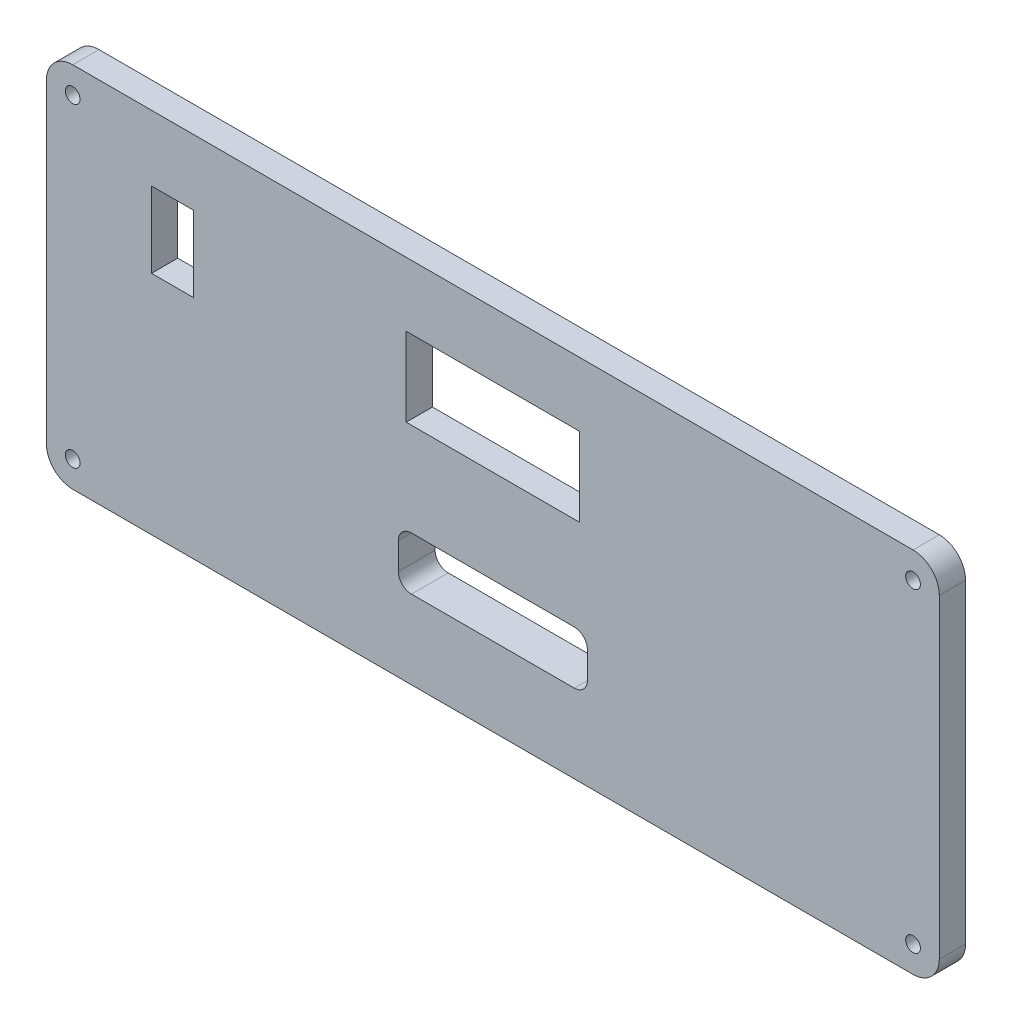
ISO-10303-21;
HEADER;
FILE_DESCRIPTION(('STEP AP214'),'2;1');
FILE_NAME('part.step','',(''),(''),'','','');
FILE_SCHEMA(('AUTOMOTIVE_DESIGN { 1 0 10303 214 1 1 1 1 }'));
ENDSEC;
DATA;
#1=APPLICATION_CONTEXT('core data for automotive mechanical design processes');
#2=APPLICATION_PROTOCOL_DEFINITION('international standard','automotive_design',2000,#1);
#3=PRODUCT_CONTEXT('',#1,'mechanical');
#4=PRODUCT('Part','Part','',(#3));
#5=PRODUCT_RELATED_PRODUCT_CATEGORY('part','',(#4));
#6=PRODUCT_DEFINITION_FORMATION('','',#4);
#7=PRODUCT_DEFINITION_CONTEXT('part definition',#1,'design');
#8=PRODUCT_DEFINITION('design','',#6,#7);
#9=PRODUCT_DEFINITION_SHAPE('','',#8);
#10=(LENGTH_UNIT() NAMED_UNIT(*) SI_UNIT(.MILLI.,.METRE.));
#11=(NAMED_UNIT(*) PLANE_ANGLE_UNIT() SI_UNIT($,.RADIAN.));
#12=(NAMED_UNIT(*) SI_UNIT($,.STERADIAN.) SOLID_ANGLE_UNIT());
#13=UNCERTAINTY_MEASURE_WITH_UNIT(LENGTH_MEASURE(1.E-05),#10,'distance_accuracy_value','');
#14=(GEOMETRIC_REPRESENTATION_CONTEXT(3) GLOBAL_UNCERTAINTY_ASSIGNED_CONTEXT((#13)) GLOBAL_UNIT_ASSIGNED_CONTEXT((#10,
#11,#12)) REPRESENTATION_CONTEXT('',''));
#15=CARTESIAN_POINT('',(0.,0.,0.));
#16=DIRECTION('',(0.,0.,1.));
#17=DIRECTION('',(1.,0.,0.));
#18=AXIS2_PLACEMENT_3D('',#15,#16,#17);
#19=CARTESIAN_POINT('',(0.,0.,5.));
#20=DIRECTION('',(0.,0.,1.));
#21=DIRECTION('',(1.,0.,0.));
#22=AXIS2_PLACEMENT_3D('',#19,#20,#21);
#23=PLANE('',#22);
#24=DIRECTION('',(0.,1.,0.));
#25=VECTOR('',#24,1.);
#26=CARTESIAN_POINT('',(-18.,-20.04,5.));
#27=LINE('',#26,#25);
#28=CARTESIAN_POINT('',(-18.,-17.54,5.));
#29=VERTEX_POINT('',#28);
#30=CARTESIAN_POINT('',(-18.,-12.46,5.));
#31=VERTEX_POINT('',#30);
#32=EDGE_CURVE('E252',#29,#31,#27,.T.);
#33=ORIENTED_EDGE('',*,*,#32,.T.);
#34=CARTESIAN_POINT('',(-15.5,-12.46,5.));
#35=DIRECTION('',(0.,0.,1.));
#36=DIRECTION('',(1.,0.,0.));
#37=AXIS2_PLACEMENT_3D('',#34,#35,#36);
#38=CIRCLE('',#37,2.5);
#39=CARTESIAN_POINT('',(-15.5,-9.96000000000001,5.));
#40=VERTEX_POINT('',#39);
#41=EDGE_CURVE('E441',#31,#40,#38,.F.);
#42=ORIENTED_EDGE('',*,*,#41,.T.);
#43=DIRECTION('',(1.,0.,0.));
#44=VECTOR('',#43,1.);
#45=CARTESIAN_POINT('',(-18.,-9.96000000000001,5.));
#46=LINE('',#45,#44);
#47=CARTESIAN_POINT('',(15.5,-9.96000000000002,5.));
#48=VERTEX_POINT('',#47);
#49=EDGE_CURVE('E247',#40,#48,#46,.T.);
#50=ORIENTED_EDGE('',*,*,#49,.T.);
#51=CARTESIAN_POINT('',(15.5,-12.46,5.));
#52=DIRECTION('',(0.,0.,1.));
#53=DIRECTION('',(1.,0.,0.));
#54=AXIS2_PLACEMENT_3D('',#51,#52,#53);
#55=CIRCLE('',#54,2.5);
#56=CARTESIAN_POINT('',(18.,-12.46,5.));
#57=VERTEX_POINT('',#56);
#58=EDGE_CURVE('E437',#48,#57,#55,.F.);
#59=ORIENTED_EDGE('',*,*,#58,.T.);
#60=DIRECTION('',(0.,-1.,0.));
#61=VECTOR('',#60,1.);
#62=CARTESIAN_POINT('',(18.,-9.96000000000002,5.));
#63=LINE('',#62,#61);
#64=CARTESIAN_POINT('',(18.,-17.54,5.));
#65=VERTEX_POINT('',#64);
#66=EDGE_CURVE('E459',#57,#65,#63,.T.);
#67=ORIENTED_EDGE('',*,*,#66,.T.);
#68=CARTESIAN_POINT('',(15.5,-17.54,5.));
#69=DIRECTION('',(0.,0.,1.));
#70=DIRECTION('',(1.,0.,0.));
#71=AXIS2_PLACEMENT_3D('',#68,#69,#70);
#72=CIRCLE('',#71,2.5);
#73=CARTESIAN_POINT('',(15.5,-20.04,5.));
#74=VERTEX_POINT('',#73);
#75=EDGE_CURVE('E433',#65,#74,#72,.F.);
#76=ORIENTED_EDGE('',*,*,#75,.T.);
#77=DIRECTION('',(-1.,0.,0.));
#78=VECTOR('',#77,1.);
#79=CARTESIAN_POINT('',(-18.,-20.04,5.));
#80=LINE('',#79,#78);
#81=CARTESIAN_POINT('',(-15.5,-20.04,5.));
#82=VERTEX_POINT('',#81);
#83=EDGE_CURVE('E457',#74,#82,#80,.T.);
#84=ORIENTED_EDGE('',*,*,#83,.T.);
#85=CARTESIAN_POINT('',(-15.5,-17.54,5.));
#86=DIRECTION('',(0.,0.,1.));
#87=DIRECTION('',(1.,0.,0.));
#88=AXIS2_PLACEMENT_3D('',#85,#86,#87);
#89=CIRCLE('',#88,2.5);
#90=EDGE_CURVE('E11',#82,#29,#89,.F.);
#91=ORIENTED_EDGE('',*,*,#90,.T.);
#92=EDGE_LOOP('',(#33,#42,#50,#59,#67,#76,#84,#91));
#93=FACE_BOUND('',#92,.T.);
#94=CARTESIAN_POINT('',(-80.,-30.,5.));
#95=DIRECTION('',(0.,0.,1.));
#96=DIRECTION('',(1.,0.,0.));
#97=AXIS2_PLACEMENT_3D('',#94,#95,#96);
#98=CIRCLE('',#97,1.4);
#99=CARTESIAN_POINT('',(-78.6,-30.,5.));
#100=VERTEX_POINT('',#99);
#101=EDGE_CURVE('E321',#100,#100,#98,.T.);
#102=ORIENTED_EDGE('',*,*,#101,.F.);
#103=EDGE_LOOP('',(#102));
#104=FACE_BOUND('',#103,.T.);
#105=CARTESIAN_POINT('',(80.,30.,5.));
#106=DIRECTION('',(0.,0.,1.));
#107=DIRECTION('',(1.,0.,0.));
#108=AXIS2_PLACEMENT_3D('',#105,#106,#107);
#109=CIRCLE('',#108,1.4);
#110=CARTESIAN_POINT('',(81.4,30.,5.));
#111=VERTEX_POINT('',#110);
#112=EDGE_CURVE('E324',#111,#111,#109,.T.);
#113=ORIENTED_EDGE('',*,*,#112,.F.);
#114=EDGE_LOOP('',(#113));
#115=FACE_BOUND('',#114,.T.);
#116=CARTESIAN_POINT('',(80.,-30.,5.));
#117=DIRECTION('',(0.,0.,1.));
#118=DIRECTION('',(1.,0.,0.));
#119=AXIS2_PLACEMENT_3D('',#116,#117,#118);
#120=CIRCLE('',#119,1.4);
#121=CARTESIAN_POINT('',(81.4,-30.,5.));
#122=VERTEX_POINT('',#121);
#123=EDGE_CURVE('E330',#122,#122,#120,.T.);
#124=ORIENTED_EDGE('',*,*,#123,.F.);
#125=EDGE_LOOP('',(#124));
#126=FACE_BOUND('',#125,.T.);
#127=CARTESIAN_POINT('',(-80.,30.,5.));
#128=DIRECTION('',(0.,0.,1.));
#129=DIRECTION('',(1.,0.,0.));
#130=AXIS2_PLACEMENT_3D('',#127,#128,#129);
#131=CIRCLE('',#130,1.4);
#132=CARTESIAN_POINT('',(-78.6,30.,5.));
#133=VERTEX_POINT('',#132);
#134=EDGE_CURVE('E335',#133,#133,#131,.T.);
#135=ORIENTED_EDGE('',*,*,#134,.F.);
#136=EDGE_LOOP('',(#135));
#137=FACE_BOUND('',#136,.T.);
#138=DIRECTION('',(-1.,0.,0.));
#139=VECTOR('',#138,1.);
#140=CARTESIAN_POINT('',(-85.,35.,5.));
#141=LINE('',#140,#139);
#142=CARTESIAN_POINT('',(80.,35.,5.));
#143=VERTEX_POINT('',#142);
#144=CARTESIAN_POINT('',(-80.,35.,5.));
#145=VERTEX_POINT('',#144);
#146=EDGE_CURVE('E344',#143,#145,#141,.T.);
#147=ORIENTED_EDGE('',*,*,#146,.T.);
#148=CARTESIAN_POINT('',(-80.,30.,5.));
#149=DIRECTION('',(0.,0.,1.));
#150=DIRECTION('',(1.,0.,0.));
#151=AXIS2_PLACEMENT_3D('',#148,#149,#150);
#152=CIRCLE('',#151,5.);
#153=CARTESIAN_POINT('',(-85.,30.,5.));
#154=VERTEX_POINT('',#153);
#155=EDGE_CURVE('E388',#145,#154,#152,.T.);
#156=ORIENTED_EDGE('',*,*,#155,.T.);
#157=DIRECTION('',(0.,-1.,0.));
#158=VECTOR('',#157,1.);
#159=CARTESIAN_POINT('',(-85.,35.,5.));
#160=LINE('',#159,#158);
#161=CARTESIAN_POINT('',(-85.,-30.,5.));
#162=VERTEX_POINT('',#161);
#163=EDGE_CURVE('E348',#154,#162,#160,.T.);
#164=ORIENTED_EDGE('',*,*,#163,.T.);
#165=CARTESIAN_POINT('',(-80.,-30.,5.));
#166=DIRECTION('',(0.,0.,1.));
#167=DIRECTION('',(1.,0.,0.));
#168=AXIS2_PLACEMENT_3D('',#165,#166,#167);
#169=CIRCLE('',#168,5.);
#170=CARTESIAN_POINT('',(-80.,-35.,5.));
#171=VERTEX_POINT('',#170);
#172=EDGE_CURVE('E386',#162,#171,#169,.T.);
#173=ORIENTED_EDGE('',*,*,#172,.T.);
#174=DIRECTION('',(1.,0.,0.));
#175=VECTOR('',#174,1.);
#176=CARTESIAN_POINT('',(-85.,-35.,5.));
#177=LINE('',#176,#175);
#178=CARTESIAN_POINT('',(80.,-35.,5.));
#179=VERTEX_POINT('',#178);
#180=EDGE_CURVE('E351',#171,#179,#177,.T.);
#181=ORIENTED_EDGE('',*,*,#180,.T.);
#182=CARTESIAN_POINT('',(80.,-30.,5.));
#183=DIRECTION('',(0.,0.,1.));
#184=DIRECTION('',(1.,0.,0.));
#185=AXIS2_PLACEMENT_3D('',#182,#183,#184);
#186=CIRCLE('',#185,5.);
#187=CARTESIAN_POINT('',(85.,-30.,5.));
#188=VERTEX_POINT('',#187);
#189=EDGE_CURVE('E384',#179,#188,#186,.T.);
#190=ORIENTED_EDGE('',*,*,#189,.T.);
#191=DIRECTION('',(0.,1.,0.));
#192=VECTOR('',#191,1.);
#193=CARTESIAN_POINT('',(85.,35.,5.));
#194=LINE('',#193,#192);
#195=CARTESIAN_POINT('',(85.,30.,5.));
#196=VERTEX_POINT('',#195);
#197=EDGE_CURVE('E341',#188,#196,#194,.T.);
#198=ORIENTED_EDGE('',*,*,#197,.T.);
#199=CARTESIAN_POINT('',(80.,30.,5.));
#200=DIRECTION('',(0.,0.,1.));
#201=DIRECTION('',(1.,0.,0.));
#202=AXIS2_PLACEMENT_3D('',#199,#200,#201);
#203=CIRCLE('',#202,5.);
#204=EDGE_CURVE('E382',#196,#143,#203,.T.);
#205=ORIENTED_EDGE('',*,*,#204,.T.);
#206=EDGE_LOOP('',(#147,#156,#164,#173,#181,#190,#198,#205));
#207=FACE_BOUND('',#206,.T.);
#208=DIRECTION('',(1.,0.,0.));
#209=VECTOR('',#208,1.);
#210=CARTESIAN_POINT('',(-16.5,22.8068719932926,5.));
#211=LINE('',#210,#209);
#212=CARTESIAN_POINT('',(-16.5,22.8068719932926,5.));
#213=VERTEX_POINT('',#212);
#214=CARTESIAN_POINT('',(16.5,22.8068719932926,5.));
#215=VERTEX_POINT('',#214);
#216=EDGE_CURVE('E292',#213,#215,#211,.T.);
#217=ORIENTED_EDGE('',*,*,#216,.T.);
#218=DIRECTION('',(0.,1.,0.));
#219=VECTOR('',#218,1.);
#220=CARTESIAN_POINT('',(16.5,7.80687199329264,5.));
#221=LINE('',#220,#219);
#222=CARTESIAN_POINT('',(16.5,7.80687199329264,5.));
#223=VERTEX_POINT('',#222);
#224=EDGE_CURVE('E289',#223,#215,#221,.T.);
#225=ORIENTED_EDGE('',*,*,#224,.F.);
#226=DIRECTION('',(1.,0.,0.));
#227=VECTOR('',#226,1.);
#228=CARTESIAN_POINT('',(0.,7.80687199329264,5.));
#229=LINE('',#228,#227);
#230=CARTESIAN_POINT('',(-16.5,7.80687199329264,5.));
#231=VERTEX_POINT('',#230);
#232=EDGE_CURVE('E287',#231,#223,#229,.T.);
#233=ORIENTED_EDGE('',*,*,#232,.F.);
#234=DIRECTION('',(0.,1.,0.));
#235=VECTOR('',#234,1.);
#236=CARTESIAN_POINT('',(-16.5,7.80687199329264,5.));
#237=LINE('',#236,#235);
#238=EDGE_CURVE('E295',#231,#213,#237,.T.);
#239=ORIENTED_EDGE('',*,*,#238,.T.);
#240=EDGE_LOOP('',(#217,#225,#233,#239));
#241=FACE_BOUND('',#240,.T.);
#242=DIRECTION('',(0.,1.,0.));
#243=VECTOR('',#242,1.);
#244=CARTESIAN_POINT('',(-57.,15.3068719932926,5.));
#245=LINE('',#244,#243);
#246=CARTESIAN_POINT('',(-57.,8.10687199329264,5.));
#247=VERTEX_POINT('',#246);
#248=CARTESIAN_POINT('',(-57.,22.5068719932926,5.));
#249=VERTEX_POINT('',#248);
#250=EDGE_CURVE('E261',#247,#249,#245,.T.);
#251=ORIENTED_EDGE('',*,*,#250,.F.);
#252=DIRECTION('',(1.,0.,0.));
#253=VECTOR('',#252,1.);
#254=CARTESIAN_POINT('',(-57.,8.10687199329264,5.));
#255=LINE('',#254,#253);
#256=CARTESIAN_POINT('',(-65.,8.10687199329263,5.));
#257=VERTEX_POINT('',#256);
#258=EDGE_CURVE('E258',#257,#247,#255,.T.);
#259=ORIENTED_EDGE('',*,*,#258,.F.);
#260=DIRECTION('',(0.,-1.,0.));
#261=VECTOR('',#260,1.);
#262=CARTESIAN_POINT('',(-65.,8.10687199329263,5.));
#263=LINE('',#262,#261);
#264=CARTESIAN_POINT('',(-65.,22.5068719932926,5.));
#265=VERTEX_POINT('',#264);
#266=EDGE_CURVE('E256',#265,#257,#263,.T.);
#267=ORIENTED_EDGE('',*,*,#266,.F.);
#268=DIRECTION('',(-1.,0.,0.));
#269=VECTOR('',#268,1.);
#270=CARTESIAN_POINT('',(-65.,22.5068719932926,5.));
#271=LINE('',#270,#269);
#272=EDGE_CURVE('E263',#249,#265,#271,.T.);
#273=ORIENTED_EDGE('',*,*,#272,.F.);
#274=EDGE_LOOP('',(#251,#259,#267,#273));
#275=FACE_BOUND('',#274,.T.);
#276=ADVANCED_FACE('F37',(#93,#104,#115,#126,#137,#207,#241,#275),#23,.T.);
#277=CARTESIAN_POINT('',(0.,0.,0.));
#278=DIRECTION('',(0.,0.,1.));
#279=DIRECTION('',(1.,0.,0.));
#280=AXIS2_PLACEMENT_3D('',#277,#278,#279);
#281=PLANE('',#280);
#282=DIRECTION('',(0.,1.,0.));
#283=VECTOR('',#282,1.);
#284=CARTESIAN_POINT('',(28.5,0.,0.));
#285=LINE('',#284,#283);
#286=CARTESIAN_POINT('',(28.5,-28.,0.));
#287=VERTEX_POINT('',#286);
#288=CARTESIAN_POINT('',(28.5,-2.00000000000001,0.));
#289=VERTEX_POINT('',#288);
#290=EDGE_CURVE('E404',#287,#289,#285,.T.);
#291=ORIENTED_EDGE('',*,*,#290,.T.);
#292=DIRECTION('',(-1.,0.,0.));
#293=VECTOR('',#292,1.);
#294=CARTESIAN_POINT('',(0.,-2.00000000000001,0.));
#295=LINE('',#294,#293);
#296=CARTESIAN_POINT('',(-28.5,-2.00000000000001,0.));
#297=VERTEX_POINT('',#296);
#298=EDGE_CURVE('E407',#289,#297,#295,.T.);
#299=ORIENTED_EDGE('',*,*,#298,.T.);
#300=DIRECTION('',(0.,-1.,0.));
#301=VECTOR('',#300,1.);
#302=CARTESIAN_POINT('',(-28.5,0.,0.));
#303=LINE('',#302,#301);
#304=CARTESIAN_POINT('',(-28.5,-28.,0.));
#305=VERTEX_POINT('',#304);
#306=EDGE_CURVE('E244',#297,#305,#303,.T.);
#307=ORIENTED_EDGE('',*,*,#306,.T.);
#308=DIRECTION('',(1.,0.,0.));
#309=VECTOR('',#308,1.);
#310=CARTESIAN_POINT('',(0.,-28.,0.));
#311=LINE('',#310,#309);
#312=EDGE_CURVE('E401',#305,#287,#311,.T.);
#313=ORIENTED_EDGE('',*,*,#312,.T.);
#314=EDGE_LOOP('',(#291,#299,#307,#313));
#315=FACE_BOUND('',#314,.T.);
#316=DIRECTION('',(0.,1.,0.));
#317=VECTOR('',#316,1.);
#318=CARTESIAN_POINT('',(16.5,7.80687199329264,0.));
#319=LINE('',#318,#317);
#320=CARTESIAN_POINT('',(16.5,7.80687199329265,0.));
#321=VERTEX_POINT('',#320);
#322=CARTESIAN_POINT('',(16.5,22.8068719932926,0.));
#323=VERTEX_POINT('',#322);
#324=EDGE_CURVE('E286',#321,#323,#319,.T.);
#325=ORIENTED_EDGE('',*,*,#324,.T.);
#326=DIRECTION('',(1.,0.,0.));
#327=VECTOR('',#326,1.);
#328=CARTESIAN_POINT('',(-16.5,22.8068719932926,0.));
#329=LINE('',#328,#327);
#330=CARTESIAN_POINT('',(-16.5,22.8068719932926,0.));
#331=VERTEX_POINT('',#330);
#332=EDGE_CURVE('E301',#331,#323,#329,.T.);
#333=ORIENTED_EDGE('',*,*,#332,.F.);
#334=DIRECTION('',(0.,1.,0.));
#335=VECTOR('',#334,1.);
#336=CARTESIAN_POINT('',(-16.5,7.80687199329264,0.));
#337=LINE('',#336,#335);
#338=CARTESIAN_POINT('',(-16.5,7.80687199329264,0.));
#339=VERTEX_POINT('',#338);
#340=EDGE_CURVE('E304',#339,#331,#337,.T.);
#341=ORIENTED_EDGE('',*,*,#340,.F.);
#342=DIRECTION('',(-1.,0.,0.));
#343=VECTOR('',#342,1.);
#344=CARTESIAN_POINT('',(0.,7.80687199329264,0.));
#345=LINE('',#344,#343);
#346=EDGE_CURVE('E290',#321,#339,#345,.T.);
#347=ORIENTED_EDGE('',*,*,#346,.F.);
#348=EDGE_LOOP('',(#325,#333,#341,#347));
#349=FACE_BOUND('',#348,.T.);
#350=CARTESIAN_POINT('',(-80.,-30.,0.));
#351=DIRECTION('',(0.,0.,1.));
#352=DIRECTION('',(1.,0.,0.));
#353=AXIS2_PLACEMENT_3D('',#350,#351,#352);
#354=CIRCLE('',#353,1.4);
#355=CARTESIAN_POINT('',(-78.6,-30.,0.));
#356=VERTEX_POINT('',#355);
#357=EDGE_CURVE('E317',#356,#356,#354,.T.);
#358=ORIENTED_EDGE('',*,*,#357,.T.);
#359=EDGE_LOOP('',(#358));
#360=FACE_BOUND('',#359,.T.);
#361=CARTESIAN_POINT('',(80.,30.,0.));
#362=DIRECTION('',(0.,0.,1.));
#363=DIRECTION('',(1.,0.,0.));
#364=AXIS2_PLACEMENT_3D('',#361,#362,#363);
#365=CIRCLE('',#364,1.4);
#366=CARTESIAN_POINT('',(81.4,30.,0.));
#367=VERTEX_POINT('',#366);
#368=EDGE_CURVE('E327',#367,#367,#365,.T.);
#369=ORIENTED_EDGE('',*,*,#368,.T.);
#370=EDGE_LOOP('',(#369));
#371=FACE_BOUND('',#370,.T.);
#372=CARTESIAN_POINT('',(80.,-30.,0.));
#373=DIRECTION('',(0.,0.,1.));
#374=DIRECTION('',(1.,0.,0.));
#375=AXIS2_PLACEMENT_3D('',#372,#373,#374);
#376=CIRCLE('',#375,1.4);
#377=CARTESIAN_POINT('',(81.4,-30.,0.));
#378=VERTEX_POINT('',#377);
#379=EDGE_CURVE('E316',#378,#378,#376,.T.);
#380=ORIENTED_EDGE('',*,*,#379,.T.);
#381=EDGE_LOOP('',(#380));
#382=FACE_BOUND('',#381,.T.);
#383=CARTESIAN_POINT('',(-80.,30.,0.));
#384=DIRECTION('',(0.,0.,1.));
#385=DIRECTION('',(1.,0.,0.));
#386=AXIS2_PLACEMENT_3D('',#383,#384,#385);
#387=CIRCLE('',#386,1.4);
#388=CARTESIAN_POINT('',(-78.6,30.,0.));
#389=VERTEX_POINT('',#388);
#390=EDGE_CURVE('E320',#389,#389,#387,.T.);
#391=ORIENTED_EDGE('',*,*,#390,.T.);
#392=EDGE_LOOP('',(#391));
#393=FACE_BOUND('',#392,.T.);
#394=DIRECTION('',(0.,-1.,0.));
#395=VECTOR('',#394,1.);
#396=CARTESIAN_POINT('',(-85.,35.,0.));
#397=LINE('',#396,#395);
#398=CARTESIAN_POINT('',(-85.,30.,0.));
#399=VERTEX_POINT('',#398);
#400=CARTESIAN_POINT('',(-85.,-30.,0.));
#401=VERTEX_POINT('',#400);
#402=EDGE_CURVE('E360',#399,#401,#397,.T.);
#403=ORIENTED_EDGE('',*,*,#402,.F.);
#404=CARTESIAN_POINT('',(-80.,30.,0.));
#405=DIRECTION('',(0.,0.,1.));
#406=DIRECTION('',(1.,0.,0.));
#407=AXIS2_PLACEMENT_3D('',#404,#405,#406);
#408=CIRCLE('',#407,5.);
#409=CARTESIAN_POINT('',(-80.,35.,0.));
#410=VERTEX_POINT('',#409);
#411=EDGE_CURVE('E375',#399,#410,#408,.F.);
#412=ORIENTED_EDGE('',*,*,#411,.T.);
#413=DIRECTION('',(-1.,0.,0.));
#414=VECTOR('',#413,1.);
#415=CARTESIAN_POINT('',(-85.,35.,0.));
#416=LINE('',#415,#414);
#417=CARTESIAN_POINT('',(80.,35.,0.));
#418=VERTEX_POINT('',#417);
#419=EDGE_CURVE('E357',#418,#410,#416,.T.);
#420=ORIENTED_EDGE('',*,*,#419,.F.);
#421=CARTESIAN_POINT('',(80.,30.,0.));
#422=DIRECTION('',(0.,0.,1.));
#423=DIRECTION('',(1.,0.,0.));
#424=AXIS2_PLACEMENT_3D('',#421,#422,#423);
#425=CIRCLE('',#424,5.);
#426=CARTESIAN_POINT('',(85.,30.,0.));
#427=VERTEX_POINT('',#426);
#428=EDGE_CURVE('E369',#418,#427,#425,.F.);
#429=ORIENTED_EDGE('',*,*,#428,.T.);
#430=DIRECTION('',(0.,1.,0.));
#431=VECTOR('',#430,1.);
#432=CARTESIAN_POINT('',(85.,35.,0.));
#433=LINE('',#432,#431);
#434=CARTESIAN_POINT('',(85.,-30.,0.));
#435=VERTEX_POINT('',#434);
#436=EDGE_CURVE('E338',#435,#427,#433,.T.);
#437=ORIENTED_EDGE('',*,*,#436,.F.);
#438=CARTESIAN_POINT('',(80.,-30.,0.));
#439=DIRECTION('',(0.,0.,1.));
#440=DIRECTION('',(1.,0.,0.));
#441=AXIS2_PLACEMENT_3D('',#438,#439,#440);
#442=CIRCLE('',#441,5.);
#443=CARTESIAN_POINT('',(80.,-35.,0.));
#444=VERTEX_POINT('',#443);
#445=EDGE_CURVE('E371',#435,#444,#442,.F.);
#446=ORIENTED_EDGE('',*,*,#445,.T.);
#447=DIRECTION('',(1.,0.,0.));
#448=VECTOR('',#447,1.);
#449=CARTESIAN_POINT('',(-85.,-35.,0.));
#450=LINE('',#449,#448);
#451=CARTESIAN_POINT('',(-80.,-35.,0.));
#452=VERTEX_POINT('',#451);
#453=EDGE_CURVE('E345',#452,#444,#450,.T.);
#454=ORIENTED_EDGE('',*,*,#453,.F.);
#455=CARTESIAN_POINT('',(-80.,-30.,0.));
#456=DIRECTION('',(0.,0.,1.));
#457=DIRECTION('',(1.,0.,0.));
#458=AXIS2_PLACEMENT_3D('',#455,#456,#457);
#459=CIRCLE('',#458,5.);
#460=EDGE_CURVE('E373',#452,#401,#459,.F.);
#461=ORIENTED_EDGE('',*,*,#460,.T.);
#462=EDGE_LOOP('',(#403,#412,#420,#429,#437,#446,#454,#461));
#463=FACE_BOUND('',#462,.T.);
#464=DIRECTION('',(1.,0.,0.));
#465=VECTOR('',#464,1.);
#466=CARTESIAN_POINT('',(-57.,8.10687199329264,0.));
#467=LINE('',#466,#465);
#468=CARTESIAN_POINT('',(-65.,8.10687199329263,0.));
#469=VERTEX_POINT('',#468);
#470=CARTESIAN_POINT('',(-57.,8.10687199329264,0.));
#471=VERTEX_POINT('',#470);
#472=EDGE_CURVE('E267',#469,#471,#467,.T.);
#473=ORIENTED_EDGE('',*,*,#472,.T.);
#474=DIRECTION('',(0.,1.,0.));
#475=VECTOR('',#474,1.);
#476=CARTESIAN_POINT('',(-57.,22.5068719932926,0.));
#477=LINE('',#476,#475);
#478=CARTESIAN_POINT('',(-57.,22.5068719932926,0.));
#479=VERTEX_POINT('',#478);
#480=EDGE_CURVE('E270',#471,#479,#477,.T.);
#481=ORIENTED_EDGE('',*,*,#480,.T.);
#482=DIRECTION('',(-1.,0.,0.));
#483=VECTOR('',#482,1.);
#484=CARTESIAN_POINT('',(-65.,22.5068719932926,0.));
#485=LINE('',#484,#483);
#486=CARTESIAN_POINT('',(-65.,22.5068719932926,0.));
#487=VERTEX_POINT('',#486);
#488=EDGE_CURVE('E273',#479,#487,#485,.T.);
#489=ORIENTED_EDGE('',*,*,#488,.T.);
#490=DIRECTION('',(0.,-1.,0.));
#491=VECTOR('',#490,1.);
#492=CARTESIAN_POINT('',(-65.,15.3068719932926,0.));
#493=LINE('',#492,#491);
#494=EDGE_CURVE('E259',#487,#469,#493,.T.);
#495=ORIENTED_EDGE('',*,*,#494,.T.);
#496=EDGE_LOOP('',(#473,#481,#489,#495));
#497=FACE_BOUND('',#496,.T.);
#498=ADVANCED_FACE('F471',(#315,#349,#360,#371,#382,#393,#463,#497),#281,.F.);
#499=CARTESIAN_POINT('',(85.,35.,5.));
#500=DIRECTION('',(-1.,0.,0.));
#501=DIRECTION('',(0.,-1.,0.));
#502=AXIS2_PLACEMENT_3D('',#499,#500,#501);
#503=PLANE('',#502);
#504=ORIENTED_EDGE('',*,*,#197,.F.);
#505=DIRECTION('',(0.,0.,-1.));
#506=VECTOR('',#505,1.);
#507=CARTESIAN_POINT('',(85.,-30.,5.));
#508=LINE('',#507,#506);
#509=EDGE_CURVE('E397',#188,#435,#508,.T.);
#510=ORIENTED_EDGE('',*,*,#509,.T.);
#511=ORIENTED_EDGE('',*,*,#436,.T.);
#512=DIRECTION('',(0.,0.,-1.));
#513=VECTOR('',#512,1.);
#514=CARTESIAN_POINT('',(85.,30.,5.));
#515=LINE('',#514,#513);
#516=EDGE_CURVE('E395',#427,#196,#515,.F.);
#517=ORIENTED_EDGE('',*,*,#516,.T.);
#518=EDGE_LOOP('',(#504,#510,#511,#517));
#519=FACE_BOUND('',#518,.T.);
#520=ADVANCED_FACE('F474',(#519),#503,.F.);
#521=CARTESIAN_POINT('',(-85.,35.,5.));
#522=DIRECTION('',(0.,-1.,0.));
#523=DIRECTION('',(0.,0.,-1.));
#524=AXIS2_PLACEMENT_3D('',#521,#522,#523);
#525=PLANE('',#524);
#526=ORIENTED_EDGE('',*,*,#419,.T.);
#527=DIRECTION('',(0.,0.,-1.));
#528=VECTOR('',#527,1.);
#529=CARTESIAN_POINT('',(-80.,35.,5.));
#530=LINE('',#529,#528);
#531=EDGE_CURVE('E380',#410,#145,#530,.F.);
#532=ORIENTED_EDGE('',*,*,#531,.T.);
#533=ORIENTED_EDGE('',*,*,#146,.F.);
#534=DIRECTION('',(0.,0.,-1.));
#535=VECTOR('',#534,1.);
#536=CARTESIAN_POINT('',(80.,35.,5.));
#537=LINE('',#536,#535);
#538=EDGE_CURVE('E377',#143,#418,#537,.T.);
#539=ORIENTED_EDGE('',*,*,#538,.T.);
#540=EDGE_LOOP('',(#526,#532,#533,#539));
#541=FACE_BOUND('',#540,.T.);
#542=ADVANCED_FACE('F538',(#541),#525,.F.);
#543=CARTESIAN_POINT('',(-85.,35.,5.));
#544=DIRECTION('',(1.,0.,0.));
#545=DIRECTION('',(0.,1.,0.));
#546=AXIS2_PLACEMENT_3D('',#543,#544,#545);
#547=PLANE('',#546);
#548=ORIENTED_EDGE('',*,*,#163,.F.);
#549=DIRECTION('',(0.,0.,-1.));
#550=VECTOR('',#549,1.);
#551=CARTESIAN_POINT('',(-85.,30.,5.));
#552=LINE('',#551,#550);
#553=EDGE_CURVE('E366',#154,#399,#552,.T.);
#554=ORIENTED_EDGE('',*,*,#553,.T.);
#555=ORIENTED_EDGE('',*,*,#402,.T.);
#556=DIRECTION('',(0.,0.,-1.));
#557=VECTOR('',#556,1.);
#558=CARTESIAN_POINT('',(-85.,-30.,5.));
#559=LINE('',#558,#557);
#560=EDGE_CURVE('E354',#401,#162,#559,.F.);
#561=ORIENTED_EDGE('',*,*,#560,.T.);
#562=EDGE_LOOP('',(#548,#554,#555,#561));
#563=FACE_BOUND('',#562,.T.);
#564=ADVANCED_FACE('F534',(#563),#547,.F.);
#565=CARTESIAN_POINT('',(-85.,-35.,5.));
#566=DIRECTION('',(0.,1.,0.));
#567=DIRECTION('',(0.,0.,1.));
#568=AXIS2_PLACEMENT_3D('',#565,#566,#567);
#569=PLANE('',#568);
#570=ORIENTED_EDGE('',*,*,#180,.F.);
#571=DIRECTION('',(0.,0.,-1.));
#572=VECTOR('',#571,1.);
#573=CARTESIAN_POINT('',(-80.,-35.,5.));
#574=LINE('',#573,#572);
#575=EDGE_CURVE('E392',#171,#452,#574,.T.);
#576=ORIENTED_EDGE('',*,*,#575,.T.);
#577=ORIENTED_EDGE('',*,*,#453,.T.);
#578=DIRECTION('',(0.,0.,-1.));
#579=VECTOR('',#578,1.);
#580=CARTESIAN_POINT('',(80.,-35.,5.));
#581=LINE('',#580,#579);
#582=EDGE_CURVE('E390',#444,#179,#581,.F.);
#583=ORIENTED_EDGE('',*,*,#582,.T.);
#584=EDGE_LOOP('',(#570,#576,#577,#583));
#585=FACE_BOUND('',#584,.T.);
#586=ADVANCED_FACE('F530',(#585),#569,.F.);
#587=CARTESIAN_POINT('',(-80.,30.,5.));
#588=DIRECTION('',(0.,0.,-1.));
#589=DIRECTION('',(-1.,0.,0.));
#590=AXIS2_PLACEMENT_3D('',#587,#588,#589);
#591=CYLINDRICAL_SURFACE('',#590,5.);
#592=ORIENTED_EDGE('',*,*,#155,.F.);
#593=ORIENTED_EDGE('',*,*,#531,.F.);
#594=ORIENTED_EDGE('',*,*,#411,.F.);
#595=ORIENTED_EDGE('',*,*,#553,.F.);
#596=EDGE_LOOP('',(#592,#593,#594,#595));
#597=FACE_BOUND('',#596,.T.);
#598=ADVANCED_FACE('F533',(#597),#591,.T.);
#599=CARTESIAN_POINT('',(-80.,-30.,5.));
#600=DIRECTION('',(0.,0.,-1.));
#601=DIRECTION('',(-1.,0.,0.));
#602=AXIS2_PLACEMENT_3D('',#599,#600,#601);
#603=CYLINDRICAL_SURFACE('',#602,5.);
#604=ORIENTED_EDGE('',*,*,#172,.F.);
#605=ORIENTED_EDGE('',*,*,#560,.F.);
#606=ORIENTED_EDGE('',*,*,#460,.F.);
#607=ORIENTED_EDGE('',*,*,#575,.F.);
#608=EDGE_LOOP('',(#604,#605,#606,#607));
#609=FACE_BOUND('',#608,.T.);
#610=ADVANCED_FACE('F548',(#609),#603,.T.);
#611=CARTESIAN_POINT('',(80.,-30.,5.));
#612=DIRECTION('',(0.,0.,-1.));
#613=DIRECTION('',(-1.,0.,0.));
#614=AXIS2_PLACEMENT_3D('',#611,#612,#613);
#615=CYLINDRICAL_SURFACE('',#614,5.);
#616=ORIENTED_EDGE('',*,*,#189,.F.);
#617=ORIENTED_EDGE('',*,*,#582,.F.);
#618=ORIENTED_EDGE('',*,*,#445,.F.);
#619=ORIENTED_EDGE('',*,*,#509,.F.);
#620=EDGE_LOOP('',(#616,#617,#618,#619));
#621=FACE_BOUND('',#620,.T.);
#622=ADVANCED_FACE('F552',(#621),#615,.T.);
#623=CARTESIAN_POINT('',(80.,30.,5.));
#624=DIRECTION('',(0.,0.,-1.));
#625=DIRECTION('',(-1.,0.,0.));
#626=AXIS2_PLACEMENT_3D('',#623,#624,#625);
#627=CYLINDRICAL_SURFACE('',#626,5.);
#628=ORIENTED_EDGE('',*,*,#204,.F.);
#629=ORIENTED_EDGE('',*,*,#516,.F.);
#630=ORIENTED_EDGE('',*,*,#428,.F.);
#631=ORIENTED_EDGE('',*,*,#538,.F.);
#632=EDGE_LOOP('',(#628,#629,#630,#631));
#633=FACE_BOUND('',#632,.T.);
#634=ADVANCED_FACE('F556',(#633),#627,.T.);
#635=CARTESIAN_POINT('',(-80.,30.,5.));
#636=DIRECTION('',(0.,0.,-1.));
#637=DIRECTION('',(-1.,0.,0.));
#638=AXIS2_PLACEMENT_3D('',#635,#636,#637);
#639=CYLINDRICAL_SURFACE('',#638,1.4);
#640=ORIENTED_EDGE('',*,*,#134,.T.);
#641=EDGE_LOOP('',(#640));
#642=FACE_BOUND('',#641,.T.);
#643=ORIENTED_EDGE('',*,*,#390,.F.);
#644=EDGE_LOOP('',(#643));
#645=FACE_BOUND('',#644,.T.);
#646=ADVANCED_FACE('F527',(#642,#645),#639,.F.);
#647=CARTESIAN_POINT('',(80.,-30.,0.));
#648=DIRECTION('',(0.,0.,1.));
#649=DIRECTION('',(1.,0.,0.));
#650=AXIS2_PLACEMENT_3D('',#647,#648,#649);
#651=CYLINDRICAL_SURFACE('',#650,1.4);
#652=ORIENTED_EDGE('',*,*,#379,.F.);
#653=EDGE_LOOP('',(#652));
#654=FACE_BOUND('',#653,.T.);
#655=ORIENTED_EDGE('',*,*,#123,.T.);
#656=EDGE_LOOP('',(#655));
#657=FACE_BOUND('',#656,.T.);
#658=ADVANCED_FACE('F802',(#654,#657),#651,.F.);
#659=CARTESIAN_POINT('',(80.,30.,0.));
#660=DIRECTION('',(0.,0.,1.));
#661=DIRECTION('',(1.,0.,0.));
#662=AXIS2_PLACEMENT_3D('',#659,#660,#661);
#663=CYLINDRICAL_SURFACE('',#662,1.4);
#664=ORIENTED_EDGE('',*,*,#368,.F.);
#665=EDGE_LOOP('',(#664));
#666=FACE_BOUND('',#665,.T.);
#667=ORIENTED_EDGE('',*,*,#112,.T.);
#668=EDGE_LOOP('',(#667));
#669=FACE_BOUND('',#668,.T.);
#670=ADVANCED_FACE('F792',(#666,#669),#663,.F.);
#671=CARTESIAN_POINT('',(-80.,-30.,0.));
#672=DIRECTION('',(0.,0.,1.));
#673=DIRECTION('',(1.,0.,0.));
#674=AXIS2_PLACEMENT_3D('',#671,#672,#673);
#675=CYLINDRICAL_SURFACE('',#674,1.4);
#676=ORIENTED_EDGE('',*,*,#357,.F.);
#677=EDGE_LOOP('',(#676));
#678=FACE_BOUND('',#677,.T.);
#679=ORIENTED_EDGE('',*,*,#101,.T.);
#680=EDGE_LOOP('',(#679));
#681=FACE_BOUND('',#680,.T.);
#682=ADVANCED_FACE('F782',(#678,#681),#675,.F.);
#683=CARTESIAN_POINT('',(16.5,7.80687199329264,5.));
#684=DIRECTION('',(-1.,0.,0.));
#685=DIRECTION('',(0.,0.,1.));
#686=AXIS2_PLACEMENT_3D('',#683,#684,#685);
#687=PLANE('',#686);
#688=ORIENTED_EDGE('',*,*,#324,.F.);
#689=DIRECTION('',(0.,0.,-1.));
#690=VECTOR('',#689,1.);
#691=CARTESIAN_POINT('',(16.5,7.80687199329264,5.));
#692=LINE('',#691,#690);
#693=EDGE_CURVE('E314',#223,#321,#692,.T.);
#694=ORIENTED_EDGE('',*,*,#693,.F.);
#695=ORIENTED_EDGE('',*,*,#224,.T.);
#696=DIRECTION('',(0.,0.,-1.));
#697=VECTOR('',#696,1.);
#698=CARTESIAN_POINT('',(16.5,22.8068719932926,5.));
#699=LINE('',#698,#697);
#700=EDGE_CURVE('E312',#215,#323,#699,.T.);
#701=ORIENTED_EDGE('',*,*,#700,.T.);
#702=EDGE_LOOP('',(#688,#694,#695,#701));
#703=FACE_BOUND('',#702,.T.);
#704=ADVANCED_FACE('F772',(#703),#687,.T.);
#705=CARTESIAN_POINT('',(-16.5,22.8068719932926,5.));
#706=DIRECTION('',(0.,1.,0.));
#707=DIRECTION('',(-1.,0.,0.));
#708=AXIS2_PLACEMENT_3D('',#705,#706,#707);
#709=PLANE('',#708);
#710=ORIENTED_EDGE('',*,*,#332,.T.);
#711=ORIENTED_EDGE('',*,*,#700,.F.);
#712=ORIENTED_EDGE('',*,*,#216,.F.);
#713=DIRECTION('',(0.,0.,-1.));
#714=VECTOR('',#713,1.);
#715=CARTESIAN_POINT('',(-16.5,22.8068719932926,5.));
#716=LINE('',#715,#714);
#717=EDGE_CURVE('E310',#213,#331,#716,.T.);
#718=ORIENTED_EDGE('',*,*,#717,.T.);
#719=EDGE_LOOP('',(#710,#711,#712,#718));
#720=FACE_BOUND('',#719,.T.);
#721=ADVANCED_FACE('F762',(#720),#709,.F.);
#722=CARTESIAN_POINT('',(-16.5,7.80687199329264,5.));
#723=DIRECTION('',(-1.,0.,0.));
#724=DIRECTION('',(0.,0.,1.));
#725=AXIS2_PLACEMENT_3D('',#722,#723,#724);
#726=PLANE('',#725);
#727=ORIENTED_EDGE('',*,*,#340,.T.);
#728=ORIENTED_EDGE('',*,*,#717,.F.);
#729=ORIENTED_EDGE('',*,*,#238,.F.);
#730=DIRECTION('',(0.,0.,-1.));
#731=VECTOR('',#730,1.);
#732=CARTESIAN_POINT('',(-16.5,7.80687199329264,5.));
#733=LINE('',#732,#731);
#734=EDGE_CURVE('E298',#231,#339,#733,.T.);
#735=ORIENTED_EDGE('',*,*,#734,.T.);
#736=EDGE_LOOP('',(#727,#728,#729,#735));
#737=FACE_BOUND('',#736,.T.);
#738=ADVANCED_FACE('F753',(#737),#726,.F.);
#739=CARTESIAN_POINT('',(0.,7.80687199329264,5.));
#740=DIRECTION('',(0.,-1.,0.));
#741=DIRECTION('',(1.,0.,0.));
#742=AXIS2_PLACEMENT_3D('',#739,#740,#741);
#743=PLANE('',#742);
#744=ORIENTED_EDGE('',*,*,#346,.T.);
#745=ORIENTED_EDGE('',*,*,#734,.F.);
#746=ORIENTED_EDGE('',*,*,#232,.T.);
#747=ORIENTED_EDGE('',*,*,#693,.T.);
#748=EDGE_LOOP('',(#744,#745,#746,#747));
#749=FACE_BOUND('',#748,.T.);
#750=ADVANCED_FACE('F732',(#749),#743,.F.);
#751=CARTESIAN_POINT('',(-57.,8.10687199329264,5.));
#752=DIRECTION('',(0.,1.,0.));
#753=DIRECTION('',(-1.,0.,0.));
#754=AXIS2_PLACEMENT_3D('',#751,#752,#753);
#755=PLANE('',#754);
#756=ORIENTED_EDGE('',*,*,#472,.F.);
#757=DIRECTION('',(0.,0.,-1.));
#758=VECTOR('',#757,1.);
#759=CARTESIAN_POINT('',(-65.,8.10687199329263,5.));
#760=LINE('',#759,#758);
#761=EDGE_CURVE('E284',#257,#469,#760,.T.);
#762=ORIENTED_EDGE('',*,*,#761,.F.);
#763=ORIENTED_EDGE('',*,*,#258,.T.);
#764=DIRECTION('',(0.,0.,-1.));
#765=VECTOR('',#764,1.);
#766=CARTESIAN_POINT('',(-57.,8.10687199329264,5.));
#767=LINE('',#766,#765);
#768=EDGE_CURVE('E281',#247,#471,#767,.T.);
#769=ORIENTED_EDGE('',*,*,#768,.T.);
#770=EDGE_LOOP('',(#756,#762,#763,#769));
#771=FACE_BOUND('',#770,.T.);
#772=ADVANCED_FACE('F494',(#771),#755,.T.);
#773=CARTESIAN_POINT('',(-57.,22.5068719932926,5.));
#774=DIRECTION('',(-1.,0.,0.));
#775=DIRECTION('',(0.,-1.,0.));
#776=AXIS2_PLACEMENT_3D('',#773,#774,#775);
#777=PLANE('',#776);
#778=ORIENTED_EDGE('',*,*,#480,.F.);
#779=ORIENTED_EDGE('',*,*,#768,.F.);
#780=ORIENTED_EDGE('',*,*,#250,.T.);
#781=DIRECTION('',(0.,0.,-1.));
#782=VECTOR('',#781,1.);
#783=CARTESIAN_POINT('',(-57.,22.5068719932926,5.));
#784=LINE('',#783,#782);
#785=EDGE_CURVE('E279',#249,#479,#784,.T.);
#786=ORIENTED_EDGE('',*,*,#785,.T.);
#787=EDGE_LOOP('',(#778,#779,#780,#786));
#788=FACE_BOUND('',#787,.T.);
#789=ADVANCED_FACE('F499',(#788),#777,.T.);
#790=CARTESIAN_POINT('',(-65.,22.5068719932926,5.));
#791=DIRECTION('',(0.,-1.,0.));
#792=DIRECTION('',(0.,0.,-1.));
#793=AXIS2_PLACEMENT_3D('',#790,#791,#792);
#794=PLANE('',#793);
#795=ORIENTED_EDGE('',*,*,#488,.F.);
#796=ORIENTED_EDGE('',*,*,#785,.F.);
#797=ORIENTED_EDGE('',*,*,#272,.T.);
#798=DIRECTION('',(0.,0.,-1.));
#799=VECTOR('',#798,1.);
#800=CARTESIAN_POINT('',(-65.,22.5068719932926,5.));
#801=LINE('',#800,#799);
#802=EDGE_CURVE('E266',#265,#487,#801,.T.);
#803=ORIENTED_EDGE('',*,*,#802,.T.);
#804=EDGE_LOOP('',(#795,#796,#797,#803));
#805=FACE_BOUND('',#804,.T.);
#806=ADVANCED_FACE('F506',(#805),#794,.T.);
#807=CARTESIAN_POINT('',(-65.,15.3068719932926,5.));
#808=DIRECTION('',(1.,0.,0.));
#809=DIRECTION('',(0.,0.,-1.));
#810=AXIS2_PLACEMENT_3D('',#807,#808,#809);
#811=PLANE('',#810);
#812=ORIENTED_EDGE('',*,*,#494,.F.);
#813=ORIENTED_EDGE('',*,*,#802,.F.);
#814=ORIENTED_EDGE('',*,*,#266,.T.);
#815=ORIENTED_EDGE('',*,*,#761,.T.);
#816=EDGE_LOOP('',(#812,#813,#814,#815));
#817=FACE_BOUND('',#816,.T.);
#818=ADVANCED_FACE('F508',(#817),#811,.T.);
#819=CARTESIAN_POINT('',(0.,-2.00000000000001,-5.));
#820=DIRECTION('',(0.,1.,0.));
#821=DIRECTION('',(0.,0.,1.));
#822=AXIS2_PLACEMENT_3D('',#819,#820,#821);
#823=PLANE('',#822);
#824=DIRECTION('',(1.,0.,0.));
#825=VECTOR('',#824,1.);
#826=CARTESIAN_POINT('',(-28.5,-2.00000000000001,-2.));
#827=LINE('',#826,#825);
#828=CARTESIAN_POINT('',(-28.5,-2.00000000000001,-2.));
#829=VERTEX_POINT('',#828);
#830=CARTESIAN_POINT('',(28.5,-2.00000000000001,-2.));
#831=VERTEX_POINT('',#830);
#832=EDGE_CURVE('E225',#829,#831,#827,.T.);
#833=ORIENTED_EDGE('',*,*,#832,.F.);
#834=DIRECTION('',(0.,0.,1.));
#835=VECTOR('',#834,1.);
#836=CARTESIAN_POINT('',(-28.5,-2.00000000000001,-5.));
#837=LINE('',#836,#835);
#838=EDGE_CURVE('E238',#829,#297,#837,.T.);
#839=ORIENTED_EDGE('',*,*,#838,.T.);
#840=ORIENTED_EDGE('',*,*,#298,.F.);
#841=DIRECTION('',(0.,0.,1.));
#842=VECTOR('',#841,1.);
#843=CARTESIAN_POINT('',(28.5,-2.00000000000001,-5.));
#844=LINE('',#843,#842);
#845=EDGE_CURVE('E240',#831,#289,#844,.T.);
#846=ORIENTED_EDGE('',*,*,#845,.F.);
#847=EDGE_LOOP('',(#833,#839,#840,#846));
#848=FACE_BOUND('',#847,.T.);
#849=ADVANCED_FACE('F236',(#848),#823,.T.);
#850=CARTESIAN_POINT('',(28.5,-2.00000000000001,-5.));
#851=DIRECTION('',(1.,0.,0.));
#852=DIRECTION('',(0.,0.,-1.));
#853=AXIS2_PLACEMENT_3D('',#850,#851,#852);
#854=PLANE('',#853);
#855=DIRECTION('',(0.,-1.,0.));
#856=VECTOR('',#855,1.);
#857=CARTESIAN_POINT('',(28.5,-2.00000000000001,-2.));
#858=LINE('',#857,#856);
#859=CARTESIAN_POINT('',(28.5,-28.,-2.));
#860=VERTEX_POINT('',#859);
#861=EDGE_CURVE('E232',#831,#860,#858,.T.);
#862=ORIENTED_EDGE('',*,*,#861,.F.);
#863=ORIENTED_EDGE('',*,*,#845,.T.);
#864=ORIENTED_EDGE('',*,*,#290,.F.);
#865=DIRECTION('',(0.,0.,1.));
#866=VECTOR('',#865,1.);
#867=CARTESIAN_POINT('',(28.5,-28.,-5.));
#868=LINE('',#867,#866);
#869=EDGE_CURVE('E249',#860,#287,#868,.T.);
#870=ORIENTED_EDGE('',*,*,#869,.F.);
#871=EDGE_LOOP('',(#862,#863,#864,#870));
#872=FACE_BOUND('',#871,.T.);
#873=ADVANCED_FACE('F469',(#872),#854,.T.);
#874=CARTESIAN_POINT('',(-28.5,-28.,-5.));
#875=DIRECTION('',(0.,-1.,0.));
#876=DIRECTION('',(0.,0.,-1.));
#877=AXIS2_PLACEMENT_3D('',#874,#875,#876);
#878=PLANE('',#877);
#879=DIRECTION('',(1.,0.,0.));
#880=VECTOR('',#879,1.);
#881=CARTESIAN_POINT('',(-28.5,-28.,-2.));
#882=LINE('',#881,#880);
#883=CARTESIAN_POINT('',(-28.5,-28.,-2.));
#884=VERTEX_POINT('',#883);
#885=EDGE_CURVE('E228',#884,#860,#882,.T.);
#886=ORIENTED_EDGE('',*,*,#885,.T.);
#887=ORIENTED_EDGE('',*,*,#869,.T.);
#888=ORIENTED_EDGE('',*,*,#312,.F.);
#889=DIRECTION('',(0.,0.,1.));
#890=VECTOR('',#889,1.);
#891=CARTESIAN_POINT('',(-28.5,-28.,-5.));
#892=LINE('',#891,#890);
#893=EDGE_CURVE('E246',#884,#305,#892,.T.);
#894=ORIENTED_EDGE('',*,*,#893,.F.);
#895=EDGE_LOOP('',(#886,#887,#888,#894));
#896=FACE_BOUND('',#895,.T.);
#897=ADVANCED_FACE('F467',(#896),#878,.T.);
#898=CARTESIAN_POINT('',(-28.5,-14.1530736168203,-5.));
#899=DIRECTION('',(-1.,0.,0.));
#900=DIRECTION('',(0.,0.,1.));
#901=AXIS2_PLACEMENT_3D('',#898,#899,#900);
#902=PLANE('',#901);
#903=DIRECTION('',(0.,-1.,0.));
#904=VECTOR('',#903,1.);
#905=CARTESIAN_POINT('',(-28.5,-2.00000000000001,-2.));
#906=LINE('',#905,#904);
#907=EDGE_CURVE('E221',#829,#884,#906,.T.);
#908=ORIENTED_EDGE('',*,*,#907,.T.);
#909=ORIENTED_EDGE('',*,*,#893,.T.);
#910=ORIENTED_EDGE('',*,*,#306,.F.);
#911=ORIENTED_EDGE('',*,*,#838,.F.);
#912=EDGE_LOOP('',(#908,#909,#910,#911));
#913=FACE_BOUND('',#912,.T.);
#914=ADVANCED_FACE('F242',(#913),#902,.T.);
#915=CARTESIAN_POINT('',(-18.,-9.96000000000001,5.));
#916=DIRECTION('',(0.,1.,0.));
#917=DIRECTION('',(-1.,0.,0.));
#918=AXIS2_PLACEMENT_3D('',#915,#916,#917);
#919=PLANE('',#918);
#920=DIRECTION('',(1.,0.,0.));
#921=VECTOR('',#920,1.);
#922=CARTESIAN_POINT('',(-18.,-9.96000000000001,-2.));
#923=LINE('',#922,#921);
#924=CARTESIAN_POINT('',(-15.5,-9.96000000000001,-2.));
#925=VERTEX_POINT('',#924);
#926=CARTESIAN_POINT('',(15.5,-9.96000000000002,-2.));
#927=VERTEX_POINT('',#926);
#928=EDGE_CURVE('E582',#925,#927,#923,.T.);
#929=ORIENTED_EDGE('',*,*,#928,.T.);
#930=DIRECTION('',(0.,0.,-1.));
#931=VECTOR('',#930,1.);
#932=CARTESIAN_POINT('',(15.5,-9.96000000000002,5.));
#933=LINE('',#932,#931);
#934=EDGE_CURVE('E425',#927,#48,#933,.F.);
#935=ORIENTED_EDGE('',*,*,#934,.T.);
#936=ORIENTED_EDGE('',*,*,#49,.F.);
#937=DIRECTION('',(0.,0.,-1.));
#938=VECTOR('',#937,1.);
#939=CARTESIAN_POINT('',(-15.5,-9.96000000000001,-2.));
#940=LINE('',#939,#938);
#941=EDGE_CURVE('E422',#40,#925,#940,.T.);
#942=ORIENTED_EDGE('',*,*,#941,.T.);
#943=EDGE_LOOP('',(#929,#935,#936,#942));
#944=FACE_BOUND('',#943,.T.);
#945=ADVANCED_FACE('F579',(#944),#919,.F.);
#946=CARTESIAN_POINT('',(-18.,-15.,5.));
#947=DIRECTION('',(-1.,0.,0.));
#948=DIRECTION('',(0.,0.,1.));
#949=AXIS2_PLACEMENT_3D('',#946,#947,#948);
#950=PLANE('',#949);
#951=DIRECTION('',(0.,1.,0.));
#952=VECTOR('',#951,1.);
#953=CARTESIAN_POINT('',(-18.,-15.,-2.));
#954=LINE('',#953,#952);
#955=CARTESIAN_POINT('',(-18.,-17.54,-2.));
#956=VERTEX_POINT('',#955);
#957=CARTESIAN_POINT('',(-18.,-12.46,-2.));
#958=VERTEX_POINT('',#957);
#959=EDGE_CURVE('E446',#956,#958,#954,.T.);
#960=ORIENTED_EDGE('',*,*,#959,.T.);
#961=DIRECTION('',(0.,0.,-1.));
#962=VECTOR('',#961,1.);
#963=CARTESIAN_POINT('',(-18.,-12.46,5.));
#964=LINE('',#963,#962);
#965=EDGE_CURVE('E52',#958,#31,#964,.F.);
#966=ORIENTED_EDGE('',*,*,#965,.T.);
#967=ORIENTED_EDGE('',*,*,#32,.F.);
#968=DIRECTION('',(0.,0.,-1.));
#969=VECTOR('',#968,1.);
#970=CARTESIAN_POINT('',(-18.,-17.54,-2.));
#971=LINE('',#970,#969);
#972=EDGE_CURVE('E427',#29,#956,#971,.T.);
#973=ORIENTED_EDGE('',*,*,#972,.T.);
#974=EDGE_LOOP('',(#960,#966,#967,#973));
#975=FACE_BOUND('',#974,.T.);
#976=ADVANCED_FACE('F455',(#975),#950,.F.);
#977=CARTESIAN_POINT('',(-18.,-20.04,5.));
#978=DIRECTION('',(0.,-1.,0.));
#979=DIRECTION('',(0.,0.,-1.));
#980=AXIS2_PLACEMENT_3D('',#977,#978,#979);
#981=PLANE('',#980);
#982=ORIENTED_EDGE('',*,*,#83,.F.);
#983=DIRECTION('',(0.,0.,-1.));
#984=VECTOR('',#983,1.);
#985=CARTESIAN_POINT('',(15.5,-20.04,-2.));
#986=LINE('',#985,#984);
#987=CARTESIAN_POINT('',(15.5,-20.04,-2.));
#988=VERTEX_POINT('',#987);
#989=EDGE_CURVE('E414',#74,#988,#986,.T.);
#990=ORIENTED_EDGE('',*,*,#989,.T.);
#991=DIRECTION('',(-1.,0.,0.));
#992=VECTOR('',#991,1.);
#993=CARTESIAN_POINT('',(-18.,-20.04,-2.));
#994=LINE('',#993,#992);
#995=CARTESIAN_POINT('',(-15.5,-20.04,-2.));
#996=VERTEX_POINT('',#995);
#997=EDGE_CURVE('E445',#988,#996,#994,.T.);
#998=ORIENTED_EDGE('',*,*,#997,.T.);
#999=DIRECTION('',(0.,0.,-1.));
#1000=VECTOR('',#999,1.);
#1001=CARTESIAN_POINT('',(-15.5,-20.04,5.));
#1002=LINE('',#1001,#1000);
#1003=EDGE_CURVE('E412',#996,#82,#1002,.F.);
#1004=ORIENTED_EDGE('',*,*,#1003,.T.);
#1005=EDGE_LOOP('',(#982,#990,#998,#1004));
#1006=FACE_BOUND('',#1005,.T.);
#1007=ADVANCED_FACE('F452',(#1006),#981,.F.);
#1008=CARTESIAN_POINT('',(18.,-15.,5.));
#1009=DIRECTION('',(1.,0.,0.));
#1010=DIRECTION('',(0.,0.,-1.));
#1011=AXIS2_PLACEMENT_3D('',#1008,#1009,#1010);
#1012=PLANE('',#1011);
#1013=DIRECTION('',(0.,-1.,0.));
#1014=VECTOR('',#1013,1.);
#1015=CARTESIAN_POINT('',(18.,-15.,-2.));
#1016=LINE('',#1015,#1014);
#1017=CARTESIAN_POINT('',(18.,-12.46,-2.));
#1018=VERTEX_POINT('',#1017);
#1019=CARTESIAN_POINT('',(18.,-17.54,-2.));
#1020=VERTEX_POINT('',#1019);
#1021=EDGE_CURVE('E409',#1018,#1020,#1016,.T.);
#1022=ORIENTED_EDGE('',*,*,#1021,.T.);
#1023=DIRECTION('',(0.,0.,-1.));
#1024=VECTOR('',#1023,1.);
#1025=CARTESIAN_POINT('',(18.,-17.54,5.));
#1026=LINE('',#1025,#1024);
#1027=EDGE_CURVE('E420',#1020,#65,#1026,.F.);
#1028=ORIENTED_EDGE('',*,*,#1027,.T.);
#1029=ORIENTED_EDGE('',*,*,#66,.F.);
#1030=DIRECTION('',(0.,0.,-1.));
#1031=VECTOR('',#1030,1.);
#1032=CARTESIAN_POINT('',(18.,-12.46,-2.));
#1033=LINE('',#1032,#1031);
#1034=EDGE_CURVE('E417',#57,#1018,#1033,.T.);
#1035=ORIENTED_EDGE('',*,*,#1034,.T.);
#1036=EDGE_LOOP('',(#1022,#1028,#1029,#1035));
#1037=FACE_BOUND('',#1036,.T.);
#1038=ADVANCED_FACE('F588',(#1037),#1012,.F.);
#1039=CARTESIAN_POINT('',(-28.5,-2.00000000000001,-2.));
#1040=DIRECTION('',(0.,0.,1.));
#1041=DIRECTION('',(1.,0.,0.));
#1042=AXIS2_PLACEMENT_3D('',#1039,#1040,#1041);
#1043=PLANE('',#1042);
#1044=ORIENTED_EDGE('',*,*,#861,.T.);
#1045=ORIENTED_EDGE('',*,*,#885,.F.);
#1046=ORIENTED_EDGE('',*,*,#907,.F.);
#1047=ORIENTED_EDGE('',*,*,#832,.T.);
#1048=EDGE_LOOP('',(#1044,#1045,#1046,#1047));
#1049=FACE_BOUND('',#1048,.T.);
#1050=ORIENTED_EDGE('',*,*,#959,.F.);
#1051=CARTESIAN_POINT('',(-15.5,-17.54,-2.));
#1052=DIRECTION('',(0.,0.,1.));
#1053=DIRECTION('',(1.,0.,0.));
#1054=AXIS2_PLACEMENT_3D('',#1051,#1052,#1053);
#1055=CIRCLE('',#1054,2.5);
#1056=EDGE_CURVE('E45',#956,#996,#1055,.T.);
#1057=ORIENTED_EDGE('',*,*,#1056,.T.);
#1058=ORIENTED_EDGE('',*,*,#997,.F.);
#1059=CARTESIAN_POINT('',(15.5,-17.54,-2.));
#1060=DIRECTION('',(0.,0.,1.));
#1061=DIRECTION('',(1.,0.,0.));
#1062=AXIS2_PLACEMENT_3D('',#1059,#1060,#1061);
#1063=CIRCLE('',#1062,2.5);
#1064=EDGE_CURVE('E431',#988,#1020,#1063,.T.);
#1065=ORIENTED_EDGE('',*,*,#1064,.T.);
#1066=ORIENTED_EDGE('',*,*,#1021,.F.);
#1067=CARTESIAN_POINT('',(15.5,-12.46,-2.));
#1068=DIRECTION('',(0.,0.,1.));
#1069=DIRECTION('',(1.,0.,0.));
#1070=AXIS2_PLACEMENT_3D('',#1067,#1068,#1069);
#1071=CIRCLE('',#1070,2.5);
#1072=EDGE_CURVE('E435',#1018,#927,#1071,.T.);
#1073=ORIENTED_EDGE('',*,*,#1072,.T.);
#1074=ORIENTED_EDGE('',*,*,#928,.F.);
#1075=CARTESIAN_POINT('',(-15.5,-12.46,-2.));
#1076=DIRECTION('',(0.,0.,1.));
#1077=DIRECTION('',(1.,0.,0.));
#1078=AXIS2_PLACEMENT_3D('',#1075,#1076,#1077);
#1079=CIRCLE('',#1078,2.5);
#1080=EDGE_CURVE('E439',#925,#958,#1079,.T.);
#1081=ORIENTED_EDGE('',*,*,#1080,.T.);
#1082=EDGE_LOOP('',(#1050,#1057,#1058,#1065,#1066,#1073,#1074,#1081));
#1083=FACE_BOUND('',#1082,.T.);
#1084=ADVANCED_FACE('F223',(#1049,#1083),#1043,.F.);
#1085=CARTESIAN_POINT('',(15.5,-17.54,5.));
#1086=DIRECTION('',(0.,0.,1.));
#1087=DIRECTION('',(1.,0.,0.));
#1088=AXIS2_PLACEMENT_3D('',#1085,#1086,#1087);
#1089=CYLINDRICAL_SURFACE('',#1088,2.5);
#1090=ORIENTED_EDGE('',*,*,#75,.F.);
#1091=ORIENTED_EDGE('',*,*,#1027,.F.);
#1092=ORIENTED_EDGE('',*,*,#1064,.F.);
#1093=ORIENTED_EDGE('',*,*,#989,.F.);
#1094=EDGE_LOOP('',(#1090,#1091,#1092,#1093));
#1095=FACE_BOUND('',#1094,.T.);
#1096=ADVANCED_FACE('F561',(#1095),#1089,.F.);
#1097=CARTESIAN_POINT('',(15.5,-12.46,5.));
#1098=DIRECTION('',(0.,0.,1.));
#1099=DIRECTION('',(1.,0.,0.));
#1100=AXIS2_PLACEMENT_3D('',#1097,#1098,#1099);
#1101=CYLINDRICAL_SURFACE('',#1100,2.5);
#1102=ORIENTED_EDGE('',*,*,#58,.F.);
#1103=ORIENTED_EDGE('',*,*,#934,.F.);
#1104=ORIENTED_EDGE('',*,*,#1072,.F.);
#1105=ORIENTED_EDGE('',*,*,#1034,.F.);
#1106=EDGE_LOOP('',(#1102,#1103,#1104,#1105));
#1107=FACE_BOUND('',#1106,.T.);
#1108=ADVANCED_FACE('F564',(#1107),#1101,.F.);
#1109=CARTESIAN_POINT('',(-15.5,-12.46,5.));
#1110=DIRECTION('',(0.,0.,1.));
#1111=DIRECTION('',(1.,0.,0.));
#1112=AXIS2_PLACEMENT_3D('',#1109,#1110,#1111);
#1113=CYLINDRICAL_SURFACE('',#1112,2.5);
#1114=ORIENTED_EDGE('',*,*,#41,.F.);
#1115=ORIENTED_EDGE('',*,*,#965,.F.);
#1116=ORIENTED_EDGE('',*,*,#1080,.F.);
#1117=ORIENTED_EDGE('',*,*,#941,.F.);
#1118=EDGE_LOOP('',(#1114,#1115,#1116,#1117));
#1119=FACE_BOUND('',#1118,.T.);
#1120=ADVANCED_FACE('F567',(#1119),#1113,.F.);
#1121=CARTESIAN_POINT('',(-15.5,-17.54,5.));
#1122=DIRECTION('',(0.,0.,1.));
#1123=DIRECTION('',(1.,0.,0.));
#1124=AXIS2_PLACEMENT_3D('',#1121,#1122,#1123);
#1125=CYLINDRICAL_SURFACE('',#1124,2.5);
#1126=ORIENTED_EDGE('',*,*,#90,.F.);
#1127=ORIENTED_EDGE('',*,*,#1003,.F.);
#1128=ORIENTED_EDGE('',*,*,#1056,.F.);
#1129=ORIENTED_EDGE('',*,*,#972,.F.);
#1130=EDGE_LOOP('',(#1126,#1127,#1128,#1129));
#1131=FACE_BOUND('',#1130,.T.);
#1132=ADVANCED_FACE('F39',(#1131),#1125,.F.);
#1133=CLOSED_SHELL('',(#276,#498,#520,#542,#564,#586,#598,#610,#622,#634,#646,#658,#670,#682,
#704,#721,#738,#750,#772,#789,#806,#818,#849,#873,#897,#914,#945,#976,#1007,#1038,#1084,#1096,
#1108,#1120,#1132));
#1134=MANIFOLD_SOLID_BREP('B2',#1133);
#1135=ADVANCED_BREP_SHAPE_REPRESENTATION('',(#18,#1134),#14);
#1136=SHAPE_DEFINITION_REPRESENTATION(#9,#1135);
ENDSEC;
END-ISO-10303-21;
